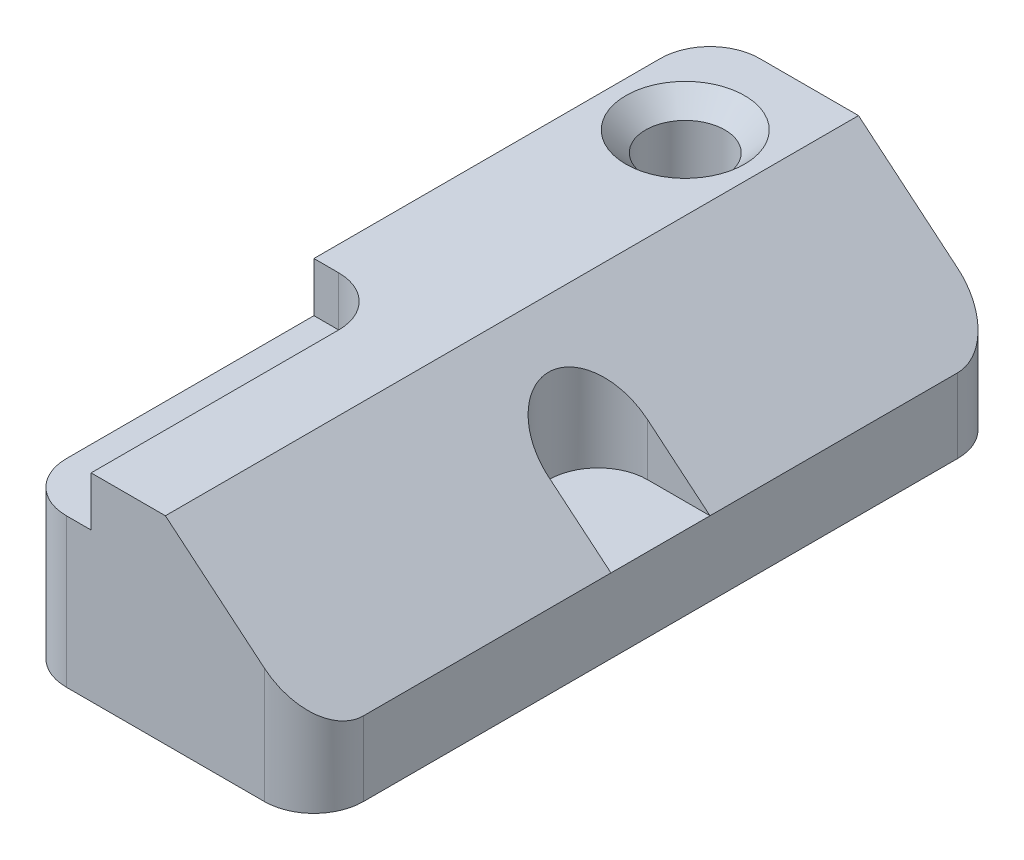
ISO-10303-21;
HEADER;
FILE_DESCRIPTION(('STEP AP214'),'2;1');
FILE_NAME('part.step','',(''),(''),'','','');
FILE_SCHEMA(('AUTOMOTIVE_DESIGN { 1 0 10303 214 1 1 1 1 }'));
ENDSEC;
DATA;
#1=APPLICATION_CONTEXT('core data for automotive mechanical design processes');
#2=APPLICATION_PROTOCOL_DEFINITION('international standard','automotive_design',2000,#1);
#3=PRODUCT_CONTEXT('',#1,'mechanical');
#4=PRODUCT('Part','Part','',(#3));
#5=PRODUCT_RELATED_PRODUCT_CATEGORY('part','',(#4));
#6=PRODUCT_DEFINITION_FORMATION('','',#4);
#7=PRODUCT_DEFINITION_CONTEXT('part definition',#1,'design');
#8=PRODUCT_DEFINITION('design','',#6,#7);
#9=PRODUCT_DEFINITION_SHAPE('','',#8);
#10=(LENGTH_UNIT() NAMED_UNIT(*) SI_UNIT(.MILLI.,.METRE.));
#11=(NAMED_UNIT(*) PLANE_ANGLE_UNIT() SI_UNIT($,.RADIAN.));
#12=(NAMED_UNIT(*) SI_UNIT($,.STERADIAN.) SOLID_ANGLE_UNIT());
#13=UNCERTAINTY_MEASURE_WITH_UNIT(LENGTH_MEASURE(1.E-05),#10,'distance_accuracy_value','');
#14=(GEOMETRIC_REPRESENTATION_CONTEXT(3) GLOBAL_UNCERTAINTY_ASSIGNED_CONTEXT((#13)) GLOBAL_UNIT_ASSIGNED_CONTEXT((#10,
#11,#12)) REPRESENTATION_CONTEXT('',''));
#15=CARTESIAN_POINT('',(0.,0.,0.));
#16=DIRECTION('',(0.,0.,1.));
#17=DIRECTION('',(1.,0.,0.));
#18=AXIS2_PLACEMENT_3D('',#15,#16,#17);
#19=CARTESIAN_POINT('',(0.,0.,-177.8));
#20=DIRECTION('',(-1.,0.,0.));
#21=DIRECTION('',(0.,0.,1.));
#22=AXIS2_PLACEMENT_3D('',#19,#20,#21);
#23=PLANE('',#22);
#24=DIRECTION('',(0.,0.,1.));
#25=VECTOR('',#24,1.);
#26=CARTESIAN_POINT('',(0.,50.8,-177.8));
#27=LINE('',#26,#25);
#28=CARTESIAN_POINT('',(0.,50.8,-165.1));
#29=VERTEX_POINT('',#28);
#30=CARTESIAN_POINT('',(0.,50.8,-76.2));
#31=VERTEX_POINT('',#30);
#32=EDGE_CURVE('E288',#29,#31,#27,.T.);
#33=ORIENTED_EDGE('',*,*,#32,.F.);
#34=DIRECTION('',(0.,-1.,0.));
#35=VECTOR('',#34,1.);
#36=CARTESIAN_POINT('',(0.,0.,-165.1));
#37=LINE('',#36,#35);
#38=CARTESIAN_POINT('',(0.,0.,-165.1));
#39=VERTEX_POINT('',#38);
#40=EDGE_CURVE('E237',#29,#39,#37,.T.);
#41=ORIENTED_EDGE('',*,*,#40,.T.);
#42=DIRECTION('',(0.,0.,1.));
#43=VECTOR('',#42,1.);
#44=CARTESIAN_POINT('',(0.,0.,-177.8));
#45=LINE('',#44,#43);
#46=CARTESIAN_POINT('',(0.,0.,-12.7));
#47=VERTEX_POINT('',#46);
#48=EDGE_CURVE('E284',#39,#47,#45,.T.);
#49=ORIENTED_EDGE('',*,*,#48,.T.);
#50=DIRECTION('',(0.,-1.,0.));
#51=VECTOR('',#50,1.);
#52=CARTESIAN_POINT('',(0.,38.1,-12.7));
#53=LINE('',#52,#51);
#54=CARTESIAN_POINT('',(0.,38.1,-12.7));
#55=VERTEX_POINT('',#54);
#56=EDGE_CURVE('E234',#47,#55,#53,.F.);
#57=ORIENTED_EDGE('',*,*,#56,.T.);
#58=DIRECTION('',(0.,0.,-1.));
#59=VECTOR('',#58,1.);
#60=CARTESIAN_POINT('',(0.,38.1,0.));
#61=LINE('',#60,#59);
#62=CARTESIAN_POINT('',(0.,38.1,-76.2));
#63=VERTEX_POINT('',#62);
#64=EDGE_CURVE('E349',#55,#63,#61,.T.);
#65=ORIENTED_EDGE('',*,*,#64,.T.);
#66=DIRECTION('',(0.,1.,0.));
#67=VECTOR('',#66,1.);
#68=CARTESIAN_POINT('',(0.,38.1,-76.2));
#69=LINE('',#68,#67);
#70=EDGE_CURVE('E328',#63,#31,#69,.T.);
#71=ORIENTED_EDGE('',*,*,#70,.T.);
#72=EDGE_LOOP('',(#33,#41,#49,#57,#65,#71));
#73=FACE_BOUND('',#72,.T.);
#74=ADVANCED_FACE('F39',(#73),#23,.T.);
#75=CARTESIAN_POINT('',(0.,50.8,-177.8));
#76=DIRECTION('',(0.,1.,0.));
#77=DIRECTION('',(0.,0.,1.));
#78=AXIS2_PLACEMENT_3D('',#75,#76,#77);
#79=PLANE('',#78);
#80=CARTESIAN_POINT('',(19.05,50.8,-152.4));
#81=DIRECTION('',(0.,1.,0.));
#82=DIRECTION('',(0.,0.,1.));
#83=AXIS2_PLACEMENT_3D('',#80,#81,#82);
#84=CIRCLE('',#83,15.24);
#85=CARTESIAN_POINT('',(19.05,50.8,-137.16));
#86=VERTEX_POINT('',#85);
#87=EDGE_CURVE('E300',#86,#86,#84,.F.);
#88=ORIENTED_EDGE('',*,*,#87,.T.);
#89=EDGE_LOOP('',(#88));
#90=FACE_BOUND('',#89,.T.);
#91=DIRECTION('',(-1.,0.,0.));
#92=VECTOR('',#91,1.);
#93=CARTESIAN_POINT('',(0.,50.8,-177.8));
#94=LINE('',#93,#92);
#95=CARTESIAN_POINT('',(38.1,50.8,-177.8));
#96=VERTEX_POINT('',#95);
#97=CARTESIAN_POINT('',(12.7,50.8,-177.8));
#98=VERTEX_POINT('',#97);
#99=EDGE_CURVE('E277',#96,#98,#94,.T.);
#100=ORIENTED_EDGE('',*,*,#99,.T.);
#101=CARTESIAN_POINT('',(12.7,50.8,-165.1));
#102=DIRECTION('',(0.,1.,0.));
#103=DIRECTION('',(0.,0.,1.));
#104=AXIS2_PLACEMENT_3D('',#101,#102,#103);
#105=CIRCLE('',#104,12.7);
#106=EDGE_CURVE('E61',#98,#29,#105,.T.);
#107=ORIENTED_EDGE('',*,*,#106,.T.);
#108=ORIENTED_EDGE('',*,*,#32,.T.);
#109=DIRECTION('',(1.,0.,0.));
#110=VECTOR('',#109,1.);
#111=CARTESIAN_POINT('',(0.,50.8,-76.2));
#112=LINE('',#111,#110);
#113=CARTESIAN_POINT('',(6.34999999999999,50.8,-76.2));
#114=VERTEX_POINT('',#113);
#115=EDGE_CURVE('E337',#31,#114,#112,.T.);
#116=ORIENTED_EDGE('',*,*,#115,.T.);
#117=CARTESIAN_POINT('',(6.34999999999999,50.8,-63.5));
#118=DIRECTION('',(0.,1.,0.));
#119=DIRECTION('',(0.,0.,1.));
#120=AXIS2_PLACEMENT_3D('',#117,#118,#119);
#121=CIRCLE('',#120,12.7);
#122=CARTESIAN_POINT('',(19.05,50.8,-63.5));
#123=VERTEX_POINT('',#122);
#124=EDGE_CURVE('E193',#114,#123,#121,.F.);
#125=ORIENTED_EDGE('',*,*,#124,.T.);
#126=DIRECTION('',(0.,0.,-1.));
#127=VECTOR('',#126,1.);
#128=CARTESIAN_POINT('',(19.05,50.8,0.));
#129=LINE('',#128,#127);
#130=CARTESIAN_POINT('',(19.05,50.8,0.));
#131=VERTEX_POINT('',#130);
#132=EDGE_CURVE('E330',#131,#123,#129,.T.);
#133=ORIENTED_EDGE('',*,*,#132,.F.);
#134=DIRECTION('',(-1.,0.,0.));
#135=VECTOR('',#134,1.);
#136=CARTESIAN_POINT('',(0.,50.8,0.));
#137=LINE('',#136,#135);
#138=CARTESIAN_POINT('',(38.1,50.8,0.));
#139=VERTEX_POINT('',#138);
#140=EDGE_CURVE('E271',#139,#131,#137,.T.);
#141=ORIENTED_EDGE('',*,*,#140,.F.);
#142=DIRECTION('',(0.,0.,1.));
#143=VECTOR('',#142,1.);
#144=CARTESIAN_POINT('',(38.1,50.8,-177.8));
#145=LINE('',#144,#143);
#146=EDGE_CURVE('E166',#96,#139,#145,.T.);
#147=ORIENTED_EDGE('',*,*,#146,.F.);
#148=EDGE_LOOP('',(#100,#107,#108,#116,#125,#133,#141,#147));
#149=FACE_BOUND('',#148,.T.);
#150=ADVANCED_FACE('F335',(#90,#149),#79,.T.);
#151=CARTESIAN_POINT('',(76.2,0.,-177.8));
#152=DIRECTION('',(0.,-1.,0.));
#153=DIRECTION('',(1.,0.,0.));
#154=AXIS2_PLACEMENT_3D('',#151,#152,#153);
#155=PLANE('',#154);
#156=CARTESIAN_POINT('',(19.05,0.,-152.4));
#157=DIRECTION('',(0.,1.,0.));
#158=DIRECTION('',(0.,0.,1.));
#159=AXIS2_PLACEMENT_3D('',#156,#157,#158);
#160=CIRCLE('',#159,10.16);
#161=CARTESIAN_POINT('',(19.05,0.,-142.24));
#162=VERTEX_POINT('',#161);
#163=EDGE_CURVE('E267',#162,#162,#160,.T.);
#164=ORIENTED_EDGE('',*,*,#163,.T.);
#165=EDGE_LOOP('',(#164));
#166=FACE_BOUND('',#165,.T.);
#167=DIRECTION('',(1.,0.,0.));
#168=VECTOR('',#167,1.);
#169=CARTESIAN_POINT('',(76.2,0.,-177.8));
#170=LINE('',#169,#168);
#171=CARTESIAN_POINT('',(12.7,0.,-177.8));
#172=VERTEX_POINT('',#171);
#173=CARTESIAN_POINT('',(63.5,0.,-177.8));
#174=VERTEX_POINT('',#173);
#175=EDGE_CURVE('E283',#172,#174,#170,.T.);
#176=ORIENTED_EDGE('',*,*,#175,.T.);
#177=CARTESIAN_POINT('',(63.5,0.,-165.1));
#178=DIRECTION('',(0.,-1.,0.));
#179=DIRECTION('',(1.,0.,0.));
#180=AXIS2_PLACEMENT_3D('',#177,#178,#179);
#181=CIRCLE('',#180,12.7);
#182=CARTESIAN_POINT('',(76.2,0.,-165.1));
#183=VERTEX_POINT('',#182);
#184=EDGE_CURVE('E231',#174,#183,#181,.T.);
#185=ORIENTED_EDGE('',*,*,#184,.T.);
#186=DIRECTION('',(0.,0.,1.));
#187=VECTOR('',#186,1.);
#188=CARTESIAN_POINT('',(76.2,0.,-177.8));
#189=LINE('',#188,#187);
#190=CARTESIAN_POINT('',(76.2,0.,-12.7));
#191=VERTEX_POINT('',#190);
#192=EDGE_CURVE('E294',#183,#191,#189,.T.);
#193=ORIENTED_EDGE('',*,*,#192,.T.);
#194=CARTESIAN_POINT('',(63.5,0.,-12.7));
#195=DIRECTION('',(0.,-1.,0.));
#196=DIRECTION('',(1.,0.,0.));
#197=AXIS2_PLACEMENT_3D('',#194,#195,#196);
#198=CIRCLE('',#197,12.7);
#199=CARTESIAN_POINT('',(63.5,0.,0.));
#200=VERTEX_POINT('',#199);
#201=EDGE_CURVE('E222',#191,#200,#198,.T.);
#202=ORIENTED_EDGE('',*,*,#201,.T.);
#203=DIRECTION('',(1.,0.,0.));
#204=VECTOR('',#203,1.);
#205=CARTESIAN_POINT('',(76.2,0.,0.));
#206=LINE('',#205,#204);
#207=CARTESIAN_POINT('',(12.7,0.,0.));
#208=VERTEX_POINT('',#207);
#209=EDGE_CURVE('E253',#208,#200,#206,.T.);
#210=ORIENTED_EDGE('',*,*,#209,.F.);
#211=CARTESIAN_POINT('',(12.7,0.,-12.7));
#212=DIRECTION('',(0.,-1.,0.));
#213=DIRECTION('',(1.,0.,0.));
#214=AXIS2_PLACEMENT_3D('',#211,#212,#213);
#215=CIRCLE('',#214,12.7);
#216=EDGE_CURVE('E225',#208,#47,#215,.T.);
#217=ORIENTED_EDGE('',*,*,#216,.T.);
#218=ORIENTED_EDGE('',*,*,#48,.F.);
#219=CARTESIAN_POINT('',(12.7,0.,-165.1));
#220=DIRECTION('',(0.,-1.,0.));
#221=DIRECTION('',(1.,0.,0.));
#222=AXIS2_PLACEMENT_3D('',#219,#220,#221);
#223=CIRCLE('',#222,12.7);
#224=EDGE_CURVE('E228',#39,#172,#223,.T.);
#225=ORIENTED_EDGE('',*,*,#224,.T.);
#226=EDGE_LOOP('',(#176,#185,#193,#202,#210,#217,#218,#225));
#227=FACE_BOUND('',#226,.T.);
#228=ADVANCED_FACE('F260',(#166,#227),#155,.T.);
#229=CARTESIAN_POINT('',(38.1,50.8,-177.8));
#230=DIRECTION('',(0.64018439966448,0.768221279597376,0.));
#231=DIRECTION('',(-0.768221279597376,0.64018439966448,0.));
#232=AXIS2_PLACEMENT_3D('',#229,#230,#231);
#233=PLANE('',#232);
#234=DIRECTION('',(0.,0.,1.));
#235=VECTOR('',#234,1.);
#236=CARTESIAN_POINT('',(76.2,19.05,-177.8));
#237=LINE('',#236,#235);
#238=CARTESIAN_POINT('',(76.2,19.05,-165.1));
#239=VERTEX_POINT('',#238);
#240=CARTESIAN_POINT('',(76.2,19.05,-101.6));
#241=VERTEX_POINT('',#240);
#242=EDGE_CURVE('E154',#239,#241,#237,.T.);
#243=ORIENTED_EDGE('',*,*,#242,.F.);
#244=CARTESIAN_POINT('',(63.5,29.6333333333333,-165.1));
#245=DIRECTION('',(0.64018439966448,0.768221279597376,0.));
#246=DIRECTION('',(-0.768221279597376,0.64018439966448,0.));
#247=AXIS2_PLACEMENT_3D('',#244,#245,#246);
#248=ELLIPSE('',#247,16.5316951473358,12.7);
#249=CARTESIAN_POINT('',(63.5,29.6333333333333,-177.8));
#250=VERTEX_POINT('',#249);
#251=EDGE_CURVE('E213',#239,#250,#248,.T.);
#252=ORIENTED_EDGE('',*,*,#251,.T.);
#253=DIRECTION('',(-0.768221279597376,0.64018439966448,0.));
#254=VECTOR('',#253,1.);
#255=CARTESIAN_POINT('',(38.1,50.8,-177.8));
#256=LINE('',#255,#254);
#257=EDGE_CURVE('E353',#250,#96,#256,.T.);
#258=ORIENTED_EDGE('',*,*,#257,.T.);
#259=ORIENTED_EDGE('',*,*,#146,.T.);
#260=DIRECTION('',(-0.768221279597376,0.64018439966448,0.));
#261=VECTOR('',#260,1.);
#262=CARTESIAN_POINT('',(38.1,50.8,0.));
#263=LINE('',#262,#261);
#264=CARTESIAN_POINT('',(63.5,29.6333333333333,0.));
#265=VERTEX_POINT('',#264);
#266=EDGE_CURVE('E266',#265,#139,#263,.T.);
#267=ORIENTED_EDGE('',*,*,#266,.F.);
#268=CARTESIAN_POINT('',(63.5,29.6333333333333,-12.7));
#269=DIRECTION('',(0.64018439966448,0.768221279597376,0.));
#270=DIRECTION('',(0.768221279597376,-0.64018439966448,0.));
#271=AXIS2_PLACEMENT_3D('',#268,#269,#270);
#272=ELLIPSE('',#271,16.5316951473358,12.7);
#273=CARTESIAN_POINT('',(76.2,19.05,-12.7));
#274=VERTEX_POINT('',#273);
#275=EDGE_CURVE('E210',#265,#274,#272,.T.);
#276=ORIENTED_EDGE('',*,*,#275,.T.);
#277=CARTESIAN_POINT('',(76.2,19.05,-76.2));
#278=VERTEX_POINT('',#277);
#279=EDGE_CURVE('E167',#278,#274,#237,.T.);
#280=ORIENTED_EDGE('',*,*,#279,.F.);
#281=DIRECTION('',(0.768221279597376,-0.64018439966448,0.));
#282=VECTOR('',#281,1.);
#283=CARTESIAN_POINT('',(38.1,50.8,-76.2));
#284=LINE('',#283,#282);
#285=CARTESIAN_POINT('',(60.198,32.385,-76.2));
#286=VERTEX_POINT('',#285);
#287=EDGE_CURVE('E197',#286,#278,#284,.T.);
#288=ORIENTED_EDGE('',*,*,#287,.F.);
#289=CARTESIAN_POINT('',(60.198,32.385,-88.9));
#290=DIRECTION('',(0.64018439966448,0.768221279597376,0.));
#291=DIRECTION('',(-0.768221279597376,0.64018439966448,0.));
#292=AXIS2_PLACEMENT_3D('',#289,#290,#291);
#293=ELLIPSE('',#292,16.5316951473358,12.7);
#294=CARTESIAN_POINT('',(60.198,32.385,-101.6));
#295=VERTEX_POINT('',#294);
#296=EDGE_CURVE('E191',#295,#286,#293,.T.);
#297=ORIENTED_EDGE('',*,*,#296,.F.);
#298=DIRECTION('',(-0.768221279597376,0.64018439966448,0.));
#299=VECTOR('',#298,1.);
#300=CARTESIAN_POINT('',(38.1,50.8,-101.6));
#301=LINE('',#300,#299);
#302=EDGE_CURVE('E173',#241,#295,#301,.T.);
#303=ORIENTED_EDGE('',*,*,#302,.F.);
#304=EDGE_LOOP('',(#243,#252,#258,#259,#267,#276,#280,#288,#297,#303));
#305=FACE_BOUND('',#304,.T.);
#306=ADVANCED_FACE('F189',(#305),#233,.T.);
#307=CARTESIAN_POINT('',(76.2,19.05,-177.8));
#308=DIRECTION('',(1.,0.,0.));
#309=DIRECTION('',(0.,0.,-1.));
#310=AXIS2_PLACEMENT_3D('',#307,#308,#309);
#311=PLANE('',#310);
#312=ORIENTED_EDGE('',*,*,#192,.F.);
#313=DIRECTION('',(0.,1.,0.));
#314=VECTOR('',#313,1.);
#315=CARTESIAN_POINT('',(76.2,19.05,-165.1));
#316=LINE('',#315,#314);
#317=EDGE_CURVE('E162',#183,#239,#316,.T.);
#318=ORIENTED_EDGE('',*,*,#317,.T.);
#319=ORIENTED_EDGE('',*,*,#242,.T.);
#320=DIRECTION('',(0.,0.,-1.));
#321=VECTOR('',#320,1.);
#322=CARTESIAN_POINT('',(76.2,19.05,-76.2));
#323=LINE('',#322,#321);
#324=EDGE_CURVE('E160',#278,#241,#323,.T.);
#325=ORIENTED_EDGE('',*,*,#324,.F.);
#326=ORIENTED_EDGE('',*,*,#279,.T.);
#327=DIRECTION('',(0.,1.,0.));
#328=VECTOR('',#327,1.);
#329=CARTESIAN_POINT('',(76.2,0.,-12.7));
#330=LINE('',#329,#328);
#331=EDGE_CURVE('E205',#274,#191,#330,.F.);
#332=ORIENTED_EDGE('',*,*,#331,.T.);
#333=EDGE_LOOP('',(#312,#318,#319,#325,#326,#332));
#334=FACE_BOUND('',#333,.T.);
#335=ADVANCED_FACE('F157',(#334),#311,.T.);
#336=CARTESIAN_POINT('',(0.,0.,-177.8));
#337=DIRECTION('',(0.,0.,-1.));
#338=DIRECTION('',(-1.,0.,0.));
#339=AXIS2_PLACEMENT_3D('',#336,#337,#338);
#340=PLANE('',#339);
#341=ORIENTED_EDGE('',*,*,#257,.F.);
#342=DIRECTION('',(0.,1.,0.));
#343=VECTOR('',#342,1.);
#344=CARTESIAN_POINT('',(63.5,0.,-177.8));
#345=LINE('',#344,#343);
#346=EDGE_CURVE('E219',#250,#174,#345,.F.);
#347=ORIENTED_EDGE('',*,*,#346,.T.);
#348=ORIENTED_EDGE('',*,*,#175,.F.);
#349=DIRECTION('',(0.,-1.,0.));
#350=VECTOR('',#349,1.);
#351=CARTESIAN_POINT('',(12.7,0.,-177.8));
#352=LINE('',#351,#350);
#353=EDGE_CURVE('E216',#172,#98,#352,.F.);
#354=ORIENTED_EDGE('',*,*,#353,.T.);
#355=ORIENTED_EDGE('',*,*,#99,.F.);
#356=EDGE_LOOP('',(#341,#347,#348,#354,#355));
#357=FACE_BOUND('',#356,.T.);
#358=ADVANCED_FACE('F368',(#357),#340,.T.);
#359=CARTESIAN_POINT('',(0.,0.,0.));
#360=DIRECTION('',(0.,0.,-1.));
#361=DIRECTION('',(-1.,0.,0.));
#362=AXIS2_PLACEMENT_3D('',#359,#360,#361);
#363=PLANE('',#362);
#364=DIRECTION('',(1.,0.,0.));
#365=VECTOR('',#364,1.);
#366=CARTESIAN_POINT('',(0.,38.1,0.));
#367=LINE('',#366,#365);
#368=CARTESIAN_POINT('',(12.7,38.1,0.));
#369=VERTEX_POINT('',#368);
#370=CARTESIAN_POINT('',(19.05,38.1,0.));
#371=VERTEX_POINT('',#370);
#372=EDGE_CURVE('E256',#369,#371,#367,.T.);
#373=ORIENTED_EDGE('',*,*,#372,.F.);
#374=DIRECTION('',(0.,-1.,0.));
#375=VECTOR('',#374,1.);
#376=CARTESIAN_POINT('',(12.7,0.,0.));
#377=LINE('',#376,#375);
#378=EDGE_CURVE('E48',#369,#208,#377,.T.);
#379=ORIENTED_EDGE('',*,*,#378,.T.);
#380=ORIENTED_EDGE('',*,*,#209,.T.);
#381=DIRECTION('',(0.,1.,0.));
#382=VECTOR('',#381,1.);
#383=CARTESIAN_POINT('',(63.5,19.05,0.));
#384=LINE('',#383,#382);
#385=EDGE_CURVE('E243',#200,#265,#384,.T.);
#386=ORIENTED_EDGE('',*,*,#385,.T.);
#387=ORIENTED_EDGE('',*,*,#266,.T.);
#388=ORIENTED_EDGE('',*,*,#140,.T.);
#389=DIRECTION('',(0.,1.,0.));
#390=VECTOR('',#389,1.);
#391=CARTESIAN_POINT('',(19.05,38.1,0.));
#392=LINE('',#391,#390);
#393=EDGE_CURVE('E274',#371,#131,#392,.T.);
#394=ORIENTED_EDGE('',*,*,#393,.F.);
#395=EDGE_LOOP('',(#373,#379,#380,#386,#387,#388,#394));
#396=FACE_BOUND('',#395,.T.);
#397=ADVANCED_FACE('F252',(#396),#363,.F.);
#398=CARTESIAN_POINT('',(19.05,0.,-152.4));
#399=DIRECTION('',(0.,1.,0.));
#400=DIRECTION('',(0.,0.,1.));
#401=AXIS2_PLACEMENT_3D('',#398,#399,#400);
#402=CYLINDRICAL_SURFACE('',#401,10.16);
#403=CARTESIAN_POINT('',(19.05,45.72,-152.4));
#404=DIRECTION('',(0.,1.,0.));
#405=DIRECTION('',(0.,0.,1.));
#406=AXIS2_PLACEMENT_3D('',#403,#404,#405);
#407=CIRCLE('',#406,10.16);
#408=CARTESIAN_POINT('',(19.05,45.72,-142.24));
#409=VERTEX_POINT('',#408);
#410=EDGE_CURVE('E287',#409,#409,#407,.T.);
#411=ORIENTED_EDGE('',*,*,#410,.T.);
#412=EDGE_LOOP('',(#411));
#413=FACE_BOUND('',#412,.T.);
#414=ORIENTED_EDGE('',*,*,#163,.F.);
#415=EDGE_LOOP('',(#414));
#416=FACE_BOUND('',#415,.T.);
#417=ADVANCED_FACE('F419',(#413,#416),#402,.F.);
#418=CARTESIAN_POINT('',(19.05,45.72,-152.4));
#419=DIRECTION('',(0.,1.,0.));
#420=DIRECTION('',(0.,0.,1.));
#421=AXIS2_PLACEMENT_3D('',#418,#419,#420);
#422=CONICAL_SURFACE('',#421,10.16,0.785398163397449);
#423=ORIENTED_EDGE('',*,*,#87,.F.);
#424=EDGE_LOOP('',(#423));
#425=FACE_BOUND('',#424,.T.);
#426=ORIENTED_EDGE('',*,*,#410,.F.);
#427=EDGE_LOOP('',(#426));
#428=FACE_BOUND('',#427,.T.);
#429=ADVANCED_FACE('F416',(#425,#428),#422,.F.);
#430=CARTESIAN_POINT('',(0.,38.1,-76.2));
#431=DIRECTION('',(0.,0.,1.));
#432=DIRECTION('',(1.,0.,0.));
#433=AXIS2_PLACEMENT_3D('',#430,#431,#432);
#434=PLANE('',#433);
#435=DIRECTION('',(1.,0.,0.));
#436=VECTOR('',#435,1.);
#437=CARTESIAN_POINT('',(0.,38.1,-76.2));
#438=LINE('',#437,#436);
#439=CARTESIAN_POINT('',(6.34999999999999,38.1,-76.2));
#440=VERTEX_POINT('',#439);
#441=EDGE_CURVE('E316',#63,#440,#438,.T.);
#442=ORIENTED_EDGE('',*,*,#441,.T.);
#443=DIRECTION('',(0.,1.,0.));
#444=VECTOR('',#443,1.);
#445=CARTESIAN_POINT('',(6.34999999999999,38.1,-76.2));
#446=LINE('',#445,#444);
#447=EDGE_CURVE('E304',#440,#114,#446,.T.);
#448=ORIENTED_EDGE('',*,*,#447,.T.);
#449=ORIENTED_EDGE('',*,*,#115,.F.);
#450=ORIENTED_EDGE('',*,*,#70,.F.);
#451=EDGE_LOOP('',(#442,#448,#449,#450));
#452=FACE_BOUND('',#451,.T.);
#453=ADVANCED_FACE('F324',(#452),#434,.T.);
#454=CARTESIAN_POINT('',(19.05,38.1,0.));
#455=DIRECTION('',(1.,0.,0.));
#456=DIRECTION('',(0.,0.,-1.));
#457=AXIS2_PLACEMENT_3D('',#454,#455,#456);
#458=PLANE('',#457);
#459=ORIENTED_EDGE('',*,*,#132,.T.);
#460=DIRECTION('',(0.,1.,0.));
#461=VECTOR('',#460,1.);
#462=CARTESIAN_POINT('',(19.05,38.1,-63.5));
#463=LINE('',#462,#461);
#464=CARTESIAN_POINT('',(19.05,38.1,-63.5));
#465=VERTEX_POINT('',#464);
#466=EDGE_CURVE('E308',#123,#465,#463,.F.);
#467=ORIENTED_EDGE('',*,*,#466,.T.);
#468=DIRECTION('',(0.,0.,-1.));
#469=VECTOR('',#468,1.);
#470=CARTESIAN_POINT('',(19.05,38.1,0.));
#471=LINE('',#470,#469);
#472=EDGE_CURVE('E318',#371,#465,#471,.T.);
#473=ORIENTED_EDGE('',*,*,#472,.F.);
#474=ORIENTED_EDGE('',*,*,#393,.T.);
#475=EDGE_LOOP('',(#459,#467,#473,#474));
#476=FACE_BOUND('',#475,.T.);
#477=ADVANCED_FACE('F339',(#476),#458,.F.);
#478=CARTESIAN_POINT('',(0.,38.1,0.));
#479=DIRECTION('',(0.,1.,0.));
#480=DIRECTION('',(0.,0.,1.));
#481=AXIS2_PLACEMENT_3D('',#478,#479,#480);
#482=PLANE('',#481);
#483=ORIENTED_EDGE('',*,*,#64,.F.);
#484=CARTESIAN_POINT('',(12.7,38.1,-12.7));
#485=DIRECTION('',(0.,1.,0.));
#486=DIRECTION('',(0.,0.,1.));
#487=AXIS2_PLACEMENT_3D('',#484,#485,#486);
#488=CIRCLE('',#487,12.7);
#489=EDGE_CURVE('E11',#55,#369,#488,.T.);
#490=ORIENTED_EDGE('',*,*,#489,.T.);
#491=ORIENTED_EDGE('',*,*,#372,.T.);
#492=ORIENTED_EDGE('',*,*,#472,.T.);
#493=CARTESIAN_POINT('',(6.34999999999999,38.1,-63.5));
#494=DIRECTION('',(0.,1.,0.));
#495=DIRECTION('',(0.,0.,1.));
#496=AXIS2_PLACEMENT_3D('',#493,#494,#495);
#497=CIRCLE('',#496,12.7);
#498=EDGE_CURVE('E199',#465,#440,#497,.T.);
#499=ORIENTED_EDGE('',*,*,#498,.T.);
#500=ORIENTED_EDGE('',*,*,#441,.F.);
#501=EDGE_LOOP('',(#483,#490,#491,#492,#499,#500));
#502=FACE_BOUND('',#501,.T.);
#503=ADVANCED_FACE('F315',(#502),#482,.T.);
#504=CARTESIAN_POINT('',(6.34999999999999,38.1,-63.5));
#505=DIRECTION('',(0.,1.,0.));
#506=DIRECTION('',(0.,0.,1.));
#507=AXIS2_PLACEMENT_3D('',#504,#505,#506);
#508=CYLINDRICAL_SURFACE('',#507,12.7);
#509=ORIENTED_EDGE('',*,*,#498,.F.);
#510=ORIENTED_EDGE('',*,*,#466,.F.);
#511=ORIENTED_EDGE('',*,*,#124,.F.);
#512=ORIENTED_EDGE('',*,*,#447,.F.);
#513=EDGE_LOOP('',(#509,#510,#511,#512));
#514=FACE_BOUND('',#513,.T.);
#515=ADVANCED_FACE('F332',(#514),#508,.F.);
#516=CARTESIAN_POINT('',(60.198,19.05,-76.2));
#517=DIRECTION('',(0.,0.,1.));
#518=DIRECTION('',(1.,0.,0.));
#519=AXIS2_PLACEMENT_3D('',#516,#517,#518);
#520=PLANE('',#519);
#521=ORIENTED_EDGE('',*,*,#287,.T.);
#522=DIRECTION('',(1.,0.,0.));
#523=VECTOR('',#522,1.);
#524=CARTESIAN_POINT('',(60.198,19.05,-76.2));
#525=LINE('',#524,#523);
#526=CARTESIAN_POINT('',(60.198,19.05,-76.2));
#527=VERTEX_POINT('',#526);
#528=EDGE_CURVE('E184',#527,#278,#525,.T.);
#529=ORIENTED_EDGE('',*,*,#528,.F.);
#530=DIRECTION('',(0.,1.,0.));
#531=VECTOR('',#530,1.);
#532=CARTESIAN_POINT('',(60.198,19.05,-76.2));
#533=LINE('',#532,#531);
#534=EDGE_CURVE('E343',#527,#286,#533,.T.);
#535=ORIENTED_EDGE('',*,*,#534,.T.);
#536=EDGE_LOOP('',(#521,#529,#535));
#537=FACE_BOUND('',#536,.T.);
#538=ADVANCED_FACE('F379',(#537),#520,.F.);
#539=CARTESIAN_POINT('',(60.198,19.05,-88.9));
#540=DIRECTION('',(0.,1.,0.));
#541=DIRECTION('',(0.,0.,1.));
#542=AXIS2_PLACEMENT_3D('',#539,#540,#541);
#543=CYLINDRICAL_SURFACE('',#542,12.7);
#544=ORIENTED_EDGE('',*,*,#296,.T.);
#545=ORIENTED_EDGE('',*,*,#534,.F.);
#546=CARTESIAN_POINT('',(60.198,19.05,-88.9));
#547=DIRECTION('',(0.,1.,0.));
#548=DIRECTION('',(0.,0.,1.));
#549=AXIS2_PLACEMENT_3D('',#546,#547,#548);
#550=CIRCLE('',#549,12.7);
#551=CARTESIAN_POINT('',(60.198,19.05,-101.6));
#552=VERTEX_POINT('',#551);
#553=EDGE_CURVE('E180',#552,#527,#550,.T.);
#554=ORIENTED_EDGE('',*,*,#553,.F.);
#555=DIRECTION('',(0.,1.,0.));
#556=VECTOR('',#555,1.);
#557=CARTESIAN_POINT('',(60.198,19.05,-101.6));
#558=LINE('',#557,#556);
#559=EDGE_CURVE('E175',#552,#295,#558,.T.);
#560=ORIENTED_EDGE('',*,*,#559,.T.);
#561=EDGE_LOOP('',(#544,#545,#554,#560));
#562=FACE_BOUND('',#561,.T.);
#563=ADVANCED_FACE('F431',(#562),#543,.F.);
#564=CARTESIAN_POINT('',(76.2,19.05,-101.6));
#565=DIRECTION('',(0.,0.,-1.));
#566=DIRECTION('',(-1.,0.,0.));
#567=AXIS2_PLACEMENT_3D('',#564,#565,#566);
#568=PLANE('',#567);
#569=ORIENTED_EDGE('',*,*,#302,.T.);
#570=ORIENTED_EDGE('',*,*,#559,.F.);
#571=DIRECTION('',(-1.,0.,0.));
#572=VECTOR('',#571,1.);
#573=CARTESIAN_POINT('',(76.2,19.05,-101.6));
#574=LINE('',#573,#572);
#575=EDGE_CURVE('E171',#241,#552,#574,.T.);
#576=ORIENTED_EDGE('',*,*,#575,.F.);
#577=EDGE_LOOP('',(#569,#570,#576));
#578=FACE_BOUND('',#577,.T.);
#579=ADVANCED_FACE('F172',(#578),#568,.F.);
#580=CARTESIAN_POINT('',(60.198,19.05,-88.9));
#581=DIRECTION('',(0.,1.,0.));
#582=DIRECTION('',(0.,0.,1.));
#583=AXIS2_PLACEMENT_3D('',#580,#581,#582);
#584=PLANE('',#583);
#585=ORIENTED_EDGE('',*,*,#324,.T.);
#586=ORIENTED_EDGE('',*,*,#575,.T.);
#587=ORIENTED_EDGE('',*,*,#553,.T.);
#588=ORIENTED_EDGE('',*,*,#528,.T.);
#589=EDGE_LOOP('',(#585,#586,#587,#588));
#590=FACE_BOUND('',#589,.T.);
#591=ADVANCED_FACE('F182',(#590),#584,.T.);
#592=CARTESIAN_POINT('',(63.5,19.05,-165.1));
#593=DIRECTION('',(0.,1.,0.));
#594=DIRECTION('',(0.,0.,1.));
#595=AXIS2_PLACEMENT_3D('',#592,#593,#594);
#596=CYLINDRICAL_SURFACE('',#595,12.7);
#597=ORIENTED_EDGE('',*,*,#184,.F.);
#598=ORIENTED_EDGE('',*,*,#346,.F.);
#599=ORIENTED_EDGE('',*,*,#251,.F.);
#600=ORIENTED_EDGE('',*,*,#317,.F.);
#601=EDGE_LOOP('',(#597,#598,#599,#600));
#602=FACE_BOUND('',#601,.T.);
#603=ADVANCED_FACE('F371',(#602),#596,.T.);
#604=CARTESIAN_POINT('',(12.7,0.,-165.1));
#605=DIRECTION('',(0.,-1.,0.));
#606=DIRECTION('',(0.,0.,-1.));
#607=AXIS2_PLACEMENT_3D('',#604,#605,#606);
#608=CYLINDRICAL_SURFACE('',#607,12.7);
#609=ORIENTED_EDGE('',*,*,#106,.F.);
#610=ORIENTED_EDGE('',*,*,#353,.F.);
#611=ORIENTED_EDGE('',*,*,#224,.F.);
#612=ORIENTED_EDGE('',*,*,#40,.F.);
#613=EDGE_LOOP('',(#609,#610,#611,#612));
#614=FACE_BOUND('',#613,.T.);
#615=ADVANCED_FACE('F363',(#614),#608,.T.);
#616=CARTESIAN_POINT('',(12.7,0.,-12.7));
#617=DIRECTION('',(0.,1.,0.));
#618=DIRECTION('',(0.,0.,1.));
#619=AXIS2_PLACEMENT_3D('',#616,#617,#618);
#620=CYLINDRICAL_SURFACE('',#619,12.7);
#621=ORIENTED_EDGE('',*,*,#489,.F.);
#622=ORIENTED_EDGE('',*,*,#56,.F.);
#623=ORIENTED_EDGE('',*,*,#216,.F.);
#624=ORIENTED_EDGE('',*,*,#378,.F.);
#625=EDGE_LOOP('',(#621,#622,#623,#624));
#626=FACE_BOUND('',#625,.T.);
#627=ADVANCED_FACE('F392',(#626),#620,.T.);
#628=CARTESIAN_POINT('',(63.5,0.,-12.7));
#629=DIRECTION('',(0.,-1.,0.));
#630=DIRECTION('',(0.,0.,-1.));
#631=AXIS2_PLACEMENT_3D('',#628,#629,#630);
#632=CYLINDRICAL_SURFACE('',#631,12.7);
#633=ORIENTED_EDGE('',*,*,#201,.F.);
#634=ORIENTED_EDGE('',*,*,#331,.F.);
#635=ORIENTED_EDGE('',*,*,#275,.F.);
#636=ORIENTED_EDGE('',*,*,#385,.F.);
#637=EDGE_LOOP('',(#633,#634,#635,#636));
#638=FACE_BOUND('',#637,.T.);
#639=ADVANCED_FACE('F41',(#638),#632,.T.);
#640=CLOSED_SHELL('',(#74,#150,#228,#306,#335,#358,#397,#417,#429,#453,#477,#503,#515,#538,#563,
#579,#591,#603,#615,#627,#639));
#641=MANIFOLD_SOLID_BREP('B2',#640);
#642=ADVANCED_BREP_SHAPE_REPRESENTATION('',(#18,#641),#14);
#643=SHAPE_DEFINITION_REPRESENTATION(#9,#642);
ENDSEC;
END-ISO-10303-21;
